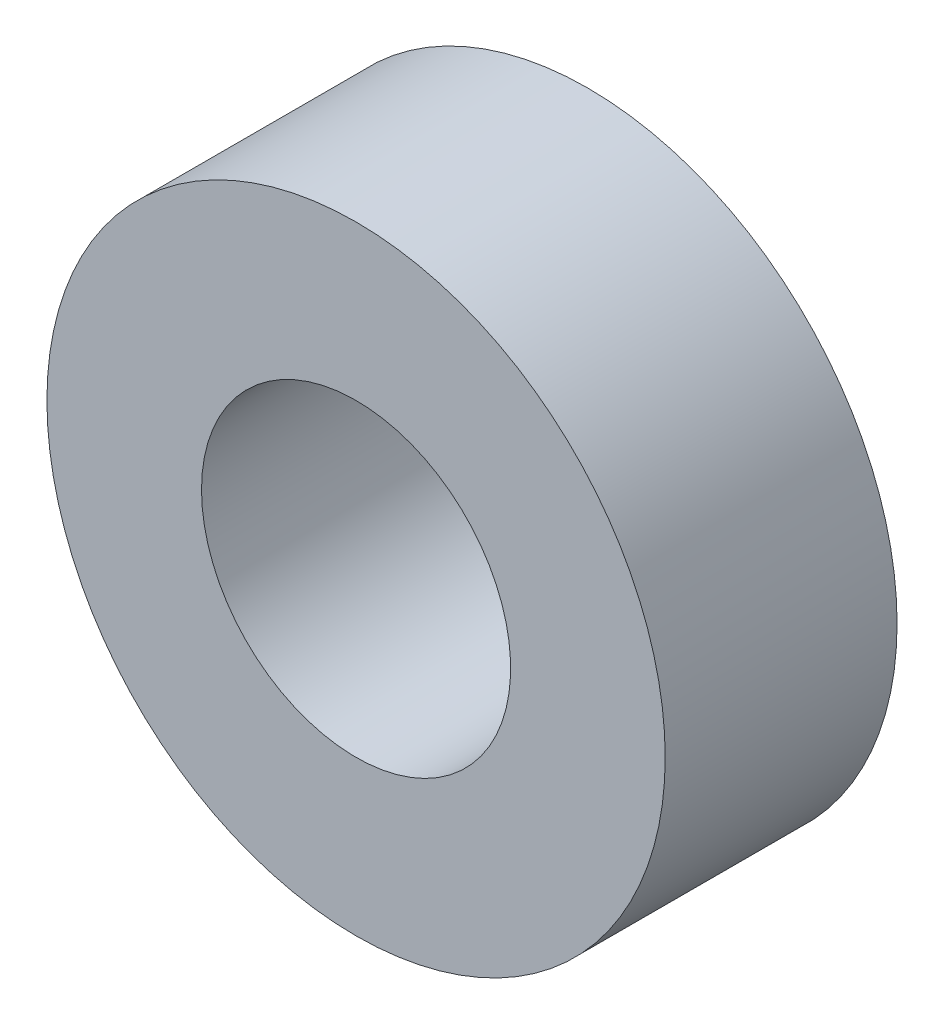
ISO-10303-21;
HEADER;
FILE_DESCRIPTION(('STEP AP214'),'2;1');
FILE_NAME('part.step','',(''),(''),'','','');
FILE_SCHEMA(('AUTOMOTIVE_DESIGN { 1 0 10303 214 1 1 1 1 }'));
ENDSEC;
DATA;
#1=APPLICATION_CONTEXT('core data for automotive mechanical design processes');
#2=APPLICATION_PROTOCOL_DEFINITION('international standard','automotive_design',2000,#1);
#3=PRODUCT_CONTEXT('',#1,'mechanical');
#4=PRODUCT('Part','Part','',(#3));
#5=PRODUCT_RELATED_PRODUCT_CATEGORY('part','',(#4));
#6=PRODUCT_DEFINITION_FORMATION('','',#4);
#7=PRODUCT_DEFINITION_CONTEXT('part definition',#1,'design');
#8=PRODUCT_DEFINITION('design','',#6,#7);
#9=PRODUCT_DEFINITION_SHAPE('','',#8);
#10=(LENGTH_UNIT() NAMED_UNIT(*) SI_UNIT(.MILLI.,.METRE.));
#11=(NAMED_UNIT(*) PLANE_ANGLE_UNIT() SI_UNIT($,.RADIAN.));
#12=(NAMED_UNIT(*) SI_UNIT($,.STERADIAN.) SOLID_ANGLE_UNIT());
#13=UNCERTAINTY_MEASURE_WITH_UNIT(LENGTH_MEASURE(1.E-05),#10,'distance_accuracy_value','');
#14=(GEOMETRIC_REPRESENTATION_CONTEXT(3) GLOBAL_UNCERTAINTY_ASSIGNED_CONTEXT((#13)) GLOBAL_UNIT_ASSIGNED_CONTEXT((#10,
#11,#12)) REPRESENTATION_CONTEXT('',''));
#15=CARTESIAN_POINT('',(0.,0.,0.));
#16=DIRECTION('',(0.,0.,1.));
#17=DIRECTION('',(1.,0.,0.));
#18=AXIS2_PLACEMENT_3D('',#15,#16,#17);
#19=CARTESIAN_POINT('',(0.,0.,4.7625));
#20=DIRECTION('',(0.,0.,-1.));
#21=DIRECTION('',(-1.,0.,0.));
#22=AXIS2_PLACEMENT_3D('',#19,#20,#21);
#23=CYLINDRICAL_SURFACE('',#22,6.35);
#24=CARTESIAN_POINT('',(0.,0.,4.7625));
#25=DIRECTION('',(0.,0.,1.));
#26=DIRECTION('',(1.,0.,0.));
#27=AXIS2_PLACEMENT_3D('',#24,#25,#26);
#28=CIRCLE('',#27,6.35);
#29=CARTESIAN_POINT('',(6.35,0.,4.7625));
#30=VERTEX_POINT('',#29);
#31=EDGE_CURVE('E10',#30,#30,#28,.T.);
#32=ORIENTED_EDGE('',*,*,#31,.F.);
#33=EDGE_LOOP('',(#32));
#34=FACE_BOUND('',#33,.T.);
#35=CARTESIAN_POINT('',(0.,0.,0.));
#36=DIRECTION('',(0.,0.,1.));
#37=DIRECTION('',(1.,0.,0.));
#38=AXIS2_PLACEMENT_3D('',#35,#36,#37);
#39=CIRCLE('',#38,6.35);
#40=CARTESIAN_POINT('',(6.35,0.,0.));
#41=VERTEX_POINT('',#40);
#42=EDGE_CURVE('E37',#41,#41,#39,.T.);
#43=ORIENTED_EDGE('',*,*,#42,.T.);
#44=EDGE_LOOP('',(#43));
#45=FACE_BOUND('',#44,.T.);
#46=ADVANCED_FACE('F34',(#34,#45),#23,.T.);
#47=CARTESIAN_POINT('',(0.,0.,4.7625));
#48=DIRECTION('',(0.,0.,1.));
#49=DIRECTION('',(1.,0.,0.));
#50=AXIS2_PLACEMENT_3D('',#47,#48,#49);
#51=PLANE('',#50);
#52=CARTESIAN_POINT('',(0.,0.,4.7625));
#53=DIRECTION('',(0.,0.,-1.));
#54=DIRECTION('',(-1.,0.,0.));
#55=AXIS2_PLACEMENT_3D('',#52,#53,#54);
#56=CIRCLE('',#55,3.175);
#57=CARTESIAN_POINT('',(-3.175,0.,4.7625));
#58=VERTEX_POINT('',#57);
#59=EDGE_CURVE('E47',#58,#58,#56,.T.);
#60=ORIENTED_EDGE('',*,*,#59,.T.);
#61=EDGE_LOOP('',(#60));
#62=FACE_BOUND('',#61,.T.);
#63=ORIENTED_EDGE('',*,*,#31,.T.);
#64=EDGE_LOOP('',(#63));
#65=FACE_BOUND('',#64,.T.);
#66=ADVANCED_FACE('F56',(#62,#65),#51,.T.);
#67=CARTESIAN_POINT('',(0.,0.,0.));
#68=DIRECTION('',(0.,0.,1.));
#69=DIRECTION('',(1.,0.,0.));
#70=AXIS2_PLACEMENT_3D('',#67,#68,#69);
#71=PLANE('',#70);
#72=CARTESIAN_POINT('',(0.,0.,0.));
#73=DIRECTION('',(0.,0.,-1.));
#74=DIRECTION('',(-1.,0.,0.));
#75=AXIS2_PLACEMENT_3D('',#72,#73,#74);
#76=CIRCLE('',#75,3.175);
#77=CARTESIAN_POINT('',(-3.175,0.,0.));
#78=VERTEX_POINT('',#77);
#79=EDGE_CURVE('E49',#78,#78,#76,.T.);
#80=ORIENTED_EDGE('',*,*,#79,.F.);
#81=EDGE_LOOP('',(#80));
#82=FACE_BOUND('',#81,.T.);
#83=ORIENTED_EDGE('',*,*,#42,.F.);
#84=EDGE_LOOP('',(#83));
#85=FACE_BOUND('',#84,.T.);
#86=ADVANCED_FACE('F61',(#82,#85),#71,.F.);
#87=CARTESIAN_POINT('',(0.,0.,4.7625));
#88=DIRECTION('',(0.,0.,-1.));
#89=DIRECTION('',(-1.,0.,0.));
#90=AXIS2_PLACEMENT_3D('',#87,#88,#89);
#91=CYLINDRICAL_SURFACE('',#90,3.175);
#92=ORIENTED_EDGE('',*,*,#59,.F.);
#93=EDGE_LOOP('',(#92));
#94=FACE_BOUND('',#93,.T.);
#95=ORIENTED_EDGE('',*,*,#79,.T.);
#96=EDGE_LOOP('',(#95));
#97=FACE_BOUND('',#96,.T.);
#98=ADVANCED_FACE('F58',(#94,#97),#91,.F.);
#99=CLOSED_SHELL('',(#46,#66,#86,#98));
#100=MANIFOLD_SOLID_BREP('B2',#99);
#101=ADVANCED_BREP_SHAPE_REPRESENTATION('',(#18,#100),#14);
#102=SHAPE_DEFINITION_REPRESENTATION(#9,#101);
ENDSEC;
END-ISO-10303-21;
